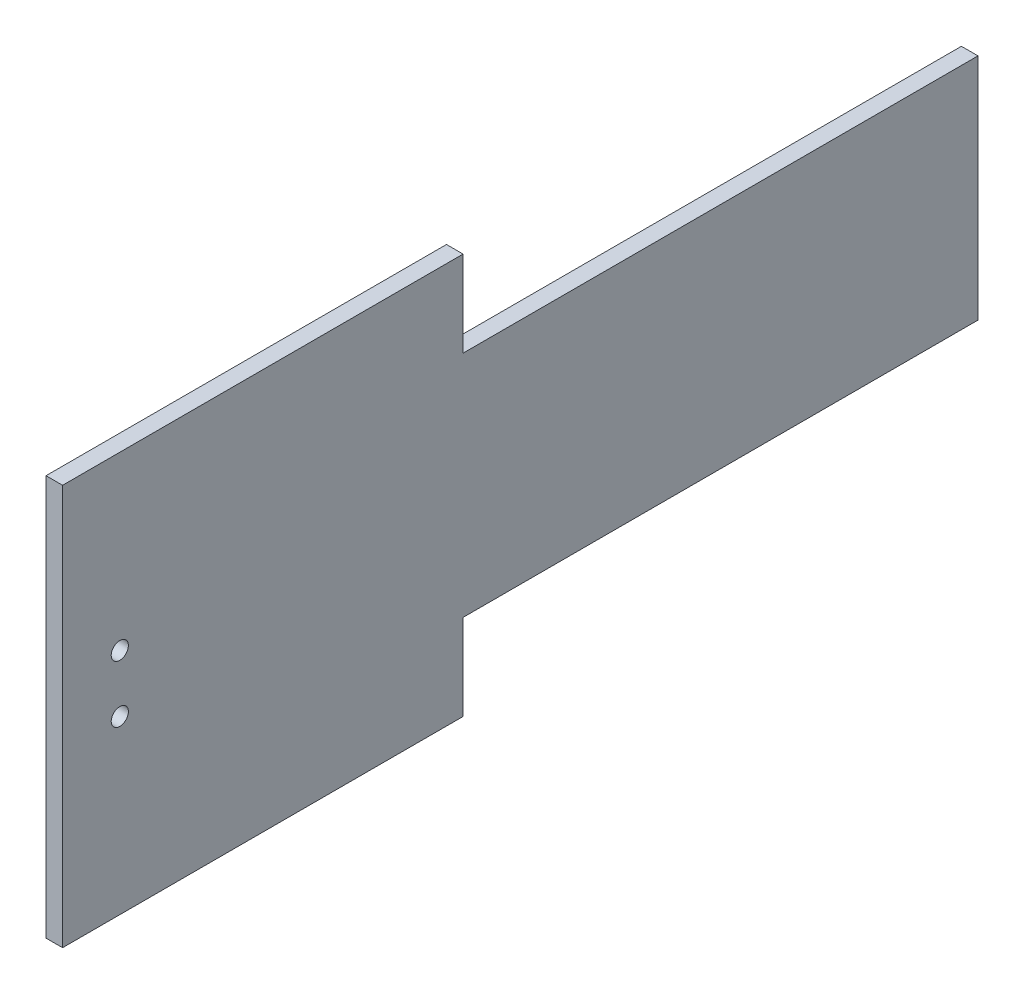
ISO-10303-21;
HEADER;
FILE_DESCRIPTION(('STEP AP214'),'2;1');
FILE_NAME('part.step','',(''),(''),'','','');
FILE_SCHEMA(('AUTOMOTIVE_DESIGN { 1 0 10303 214 1 1 1 1 }'));
ENDSEC;
DATA;
#1=APPLICATION_CONTEXT('core data for automotive mechanical design processes');
#2=APPLICATION_PROTOCOL_DEFINITION('international standard','automotive_design',2000,#1);
#3=PRODUCT_CONTEXT('',#1,'mechanical');
#4=PRODUCT('Part','Part','',(#3));
#5=PRODUCT_RELATED_PRODUCT_CATEGORY('part','',(#4));
#6=PRODUCT_DEFINITION_FORMATION('','',#4);
#7=PRODUCT_DEFINITION_CONTEXT('part definition',#1,'design');
#8=PRODUCT_DEFINITION('design','',#6,#7);
#9=PRODUCT_DEFINITION_SHAPE('','',#8);
#10=(LENGTH_UNIT() NAMED_UNIT(*) SI_UNIT(.MILLI.,.METRE.));
#11=(NAMED_UNIT(*) PLANE_ANGLE_UNIT() SI_UNIT($,.RADIAN.));
#12=(NAMED_UNIT(*) SI_UNIT($,.STERADIAN.) SOLID_ANGLE_UNIT());
#13=UNCERTAINTY_MEASURE_WITH_UNIT(LENGTH_MEASURE(1.E-05),#10,'distance_accuracy_value','');
#14=(GEOMETRIC_REPRESENTATION_CONTEXT(3) GLOBAL_UNCERTAINTY_ASSIGNED_CONTEXT((#13)) GLOBAL_UNIT_ASSIGNED_CONTEXT((#10,
#11,#12)) REPRESENTATION_CONTEXT('',''));
#15=CARTESIAN_POINT('',(0.,0.,0.));
#16=DIRECTION('',(0.,0.,1.));
#17=DIRECTION('',(1.,0.,0.));
#18=AXIS2_PLACEMENT_3D('',#15,#16,#17);
#19=CARTESIAN_POINT('',(2.9,0.,0.));
#20=DIRECTION('',(1.,0.,0.));
#21=DIRECTION('',(0.,0.,-1.));
#22=AXIS2_PLACEMENT_3D('',#19,#20,#21);
#23=PLANE('',#22);
#24=CARTESIAN_POINT('',(2.9,5.,25.));
#25=DIRECTION('',(1.,0.,0.));
#26=DIRECTION('',(0.,0.,-1.));
#27=AXIS2_PLACEMENT_3D('',#24,#25,#26);
#28=CIRCLE('',#27,1.5);
#29=CARTESIAN_POINT('',(2.9,5.,23.5));
#30=VERTEX_POINT('',#29);
#31=EDGE_CURVE('E134',#30,#30,#28,.T.);
#32=ORIENTED_EDGE('',*,*,#31,.F.);
#33=EDGE_LOOP('',(#32));
#34=FACE_BOUND('',#33,.T.);
#35=DIRECTION('',(0.,1.,0.));
#36=VECTOR('',#35,1.);
#37=CARTESIAN_POINT('',(2.9,-20.,-35.));
#38=LINE('',#37,#36);
#39=CARTESIAN_POINT('',(2.9,-35.,-35.));
#40=VERTEX_POINT('',#39);
#41=CARTESIAN_POINT('',(2.9,-20.,-35.));
#42=VERTEX_POINT('',#41);
#43=EDGE_CURVE('E145',#40,#42,#38,.T.);
#44=ORIENTED_EDGE('',*,*,#43,.T.);
#45=DIRECTION('',(0.,0.,-1.));
#46=VECTOR('',#45,1.);
#47=CARTESIAN_POINT('',(2.9,-20.,-125.));
#48=LINE('',#47,#46);
#49=CARTESIAN_POINT('',(2.9,-20.,-125.));
#50=VERTEX_POINT('',#49);
#51=EDGE_CURVE('E93',#42,#50,#48,.T.);
#52=ORIENTED_EDGE('',*,*,#51,.T.);
#53=DIRECTION('',(0.,1.,0.));
#54=VECTOR('',#53,1.);
#55=CARTESIAN_POINT('',(2.9,-20.,-125.));
#56=LINE('',#55,#54);
#57=CARTESIAN_POINT('',(2.9,20.,-125.));
#58=VERTEX_POINT('',#57);
#59=EDGE_CURVE('E160',#50,#58,#56,.T.);
#60=ORIENTED_EDGE('',*,*,#59,.T.);
#61=DIRECTION('',(0.,0.,1.));
#62=VECTOR('',#61,1.);
#63=CARTESIAN_POINT('',(2.9,20.,-125.));
#64=LINE('',#63,#62);
#65=CARTESIAN_POINT('',(2.9,20.,-35.));
#66=VERTEX_POINT('',#65);
#67=EDGE_CURVE('E173',#58,#66,#64,.T.);
#68=ORIENTED_EDGE('',*,*,#67,.T.);
#69=DIRECTION('',(0.,1.,0.));
#70=VECTOR('',#69,1.);
#71=CARTESIAN_POINT('',(2.9,35.,-35.));
#72=LINE('',#71,#70);
#73=CARTESIAN_POINT('',(2.9,35.,-35.));
#74=VERTEX_POINT('',#73);
#75=EDGE_CURVE('E112',#66,#74,#72,.T.);
#76=ORIENTED_EDGE('',*,*,#75,.T.);
#77=DIRECTION('',(0.,0.,1.));
#78=VECTOR('',#77,1.);
#79=CARTESIAN_POINT('',(2.9,35.,35.));
#80=LINE('',#79,#78);
#81=CARTESIAN_POINT('',(2.9,35.,35.));
#82=VERTEX_POINT('',#81);
#83=EDGE_CURVE('E106',#74,#82,#80,.T.);
#84=ORIENTED_EDGE('',*,*,#83,.T.);
#85=DIRECTION('',(0.,-1.,0.));
#86=VECTOR('',#85,1.);
#87=CARTESIAN_POINT('',(2.9,35.,35.));
#88=LINE('',#87,#86);
#89=CARTESIAN_POINT('',(2.9,-35.,35.));
#90=VERTEX_POINT('',#89);
#91=EDGE_CURVE('E110',#82,#90,#88,.T.);
#92=ORIENTED_EDGE('',*,*,#91,.T.);
#93=DIRECTION('',(0.,0.,-1.));
#94=VECTOR('',#93,1.);
#95=CARTESIAN_POINT('',(2.9,-35.,35.));
#96=LINE('',#95,#94);
#97=EDGE_CURVE('E50',#90,#40,#96,.T.);
#98=ORIENTED_EDGE('',*,*,#97,.T.);
#99=EDGE_LOOP('',(#44,#52,#60,#68,#76,#84,#92,#98));
#100=FACE_BOUND('',#99,.T.);
#101=CARTESIAN_POINT('',(2.9,-5.,25.));
#102=DIRECTION('',(1.,0.,0.));
#103=DIRECTION('',(0.,0.,-1.));
#104=AXIS2_PLACEMENT_3D('',#101,#102,#103);
#105=CIRCLE('',#104,1.5);
#106=CARTESIAN_POINT('',(2.9,-5.,23.5));
#107=VERTEX_POINT('',#106);
#108=EDGE_CURVE('E182',#107,#107,#105,.T.);
#109=ORIENTED_EDGE('',*,*,#108,.F.);
#110=EDGE_LOOP('',(#109));
#111=FACE_BOUND('',#110,.T.);
#112=ADVANCED_FACE('F33',(#34,#100,#111),#23,.T.);
#113=CARTESIAN_POINT('',(0.,0.,0.));
#114=DIRECTION('',(1.,0.,0.));
#115=DIRECTION('',(0.,0.,-1.));
#116=AXIS2_PLACEMENT_3D('',#113,#114,#115);
#117=PLANE('',#116);
#118=DIRECTION('',(0.,1.,0.));
#119=VECTOR('',#118,1.);
#120=CARTESIAN_POINT('',(0.,-20.,-35.));
#121=LINE('',#120,#119);
#122=CARTESIAN_POINT('',(0.,-35.,-35.));
#123=VERTEX_POINT('',#122);
#124=CARTESIAN_POINT('',(0.,-20.,-35.));
#125=VERTEX_POINT('',#124);
#126=EDGE_CURVE('E130',#123,#125,#121,.T.);
#127=ORIENTED_EDGE('',*,*,#126,.F.);
#128=DIRECTION('',(0.,0.,-1.));
#129=VECTOR('',#128,1.);
#130=CARTESIAN_POINT('',(0.,-35.,35.));
#131=LINE('',#130,#129);
#132=CARTESIAN_POINT('',(0.,-35.,35.));
#133=VERTEX_POINT('',#132);
#134=EDGE_CURVE('E85',#133,#123,#131,.T.);
#135=ORIENTED_EDGE('',*,*,#134,.F.);
#136=DIRECTION('',(0.,-1.,0.));
#137=VECTOR('',#136,1.);
#138=CARTESIAN_POINT('',(0.,35.,35.));
#139=LINE('',#138,#137);
#140=CARTESIAN_POINT('',(0.,35.,35.));
#141=VERTEX_POINT('',#140);
#142=EDGE_CURVE('E79',#141,#133,#139,.T.);
#143=ORIENTED_EDGE('',*,*,#142,.F.);
#144=DIRECTION('',(0.,0.,1.));
#145=VECTOR('',#144,1.);
#146=CARTESIAN_POINT('',(0.,35.,35.));
#147=LINE('',#146,#145);
#148=CARTESIAN_POINT('',(0.,35.,-35.));
#149=VERTEX_POINT('',#148);
#150=EDGE_CURVE('E120',#149,#141,#147,.T.);
#151=ORIENTED_EDGE('',*,*,#150,.F.);
#152=DIRECTION('',(0.,1.,0.));
#153=VECTOR('',#152,1.);
#154=CARTESIAN_POINT('',(0.,35.,-35.));
#155=LINE('',#154,#153);
#156=CARTESIAN_POINT('',(0.,20.,-35.));
#157=VERTEX_POINT('',#156);
#158=EDGE_CURVE('E140',#157,#149,#155,.T.);
#159=ORIENTED_EDGE('',*,*,#158,.F.);
#160=DIRECTION('',(0.,0.,1.));
#161=VECTOR('',#160,1.);
#162=CARTESIAN_POINT('',(0.,20.,-125.));
#163=LINE('',#162,#161);
#164=CARTESIAN_POINT('',(0.,20.,-125.));
#165=VERTEX_POINT('',#164);
#166=EDGE_CURVE('E138',#165,#157,#163,.T.);
#167=ORIENTED_EDGE('',*,*,#166,.F.);
#168=DIRECTION('',(0.,1.,0.));
#169=VECTOR('',#168,1.);
#170=CARTESIAN_POINT('',(0.,-20.,-125.));
#171=LINE('',#170,#169);
#172=CARTESIAN_POINT('',(0.,-20.,-125.));
#173=VERTEX_POINT('',#172);
#174=EDGE_CURVE('E136',#173,#165,#171,.T.);
#175=ORIENTED_EDGE('',*,*,#174,.F.);
#176=DIRECTION('',(0.,0.,-1.));
#177=VECTOR('',#176,1.);
#178=CARTESIAN_POINT('',(0.,-20.,-125.));
#179=LINE('',#178,#177);
#180=EDGE_CURVE('E133',#125,#173,#179,.T.);
#181=ORIENTED_EDGE('',*,*,#180,.F.);
#182=EDGE_LOOP('',(#127,#135,#143,#151,#159,#167,#175,#181));
#183=FACE_BOUND('',#182,.T.);
#184=CARTESIAN_POINT('',(0.,5.,25.));
#185=DIRECTION('',(1.,0.,0.));
#186=DIRECTION('',(0.,0.,-1.));
#187=AXIS2_PLACEMENT_3D('',#184,#185,#186);
#188=CIRCLE('',#187,1.5);
#189=CARTESIAN_POINT('',(0.,5.,23.5));
#190=VERTEX_POINT('',#189);
#191=EDGE_CURVE('E179',#190,#190,#188,.T.);
#192=ORIENTED_EDGE('',*,*,#191,.T.);
#193=EDGE_LOOP('',(#192));
#194=FACE_BOUND('',#193,.T.);
#195=CARTESIAN_POINT('',(0.,-5.,25.));
#196=DIRECTION('',(1.,0.,0.));
#197=DIRECTION('',(0.,0.,-1.));
#198=AXIS2_PLACEMENT_3D('',#195,#196,#197);
#199=CIRCLE('',#198,1.5);
#200=CARTESIAN_POINT('',(0.,-5.,23.5));
#201=VERTEX_POINT('',#200);
#202=EDGE_CURVE('E185',#201,#201,#199,.T.);
#203=ORIENTED_EDGE('',*,*,#202,.T.);
#204=EDGE_LOOP('',(#203));
#205=FACE_BOUND('',#204,.T.);
#206=ADVANCED_FACE('F164',(#183,#194,#205),#117,.F.);
#207=CARTESIAN_POINT('',(2.9,-20.,-35.));
#208=DIRECTION('',(0.,0.,1.));
#209=DIRECTION('',(0.,-1.,0.));
#210=AXIS2_PLACEMENT_3D('',#207,#208,#209);
#211=PLANE('',#210);
#212=ORIENTED_EDGE('',*,*,#126,.T.);
#213=DIRECTION('',(-1.,0.,0.));
#214=VECTOR('',#213,1.);
#215=CARTESIAN_POINT('',(2.9,-20.,-35.));
#216=LINE('',#215,#214);
#217=EDGE_CURVE('E11',#42,#125,#216,.T.);
#218=ORIENTED_EDGE('',*,*,#217,.F.);
#219=ORIENTED_EDGE('',*,*,#43,.F.);
#220=DIRECTION('',(-1.,0.,0.));
#221=VECTOR('',#220,1.);
#222=CARTESIAN_POINT('',(2.9,-35.,-35.));
#223=LINE('',#222,#221);
#224=EDGE_CURVE('E126',#40,#123,#223,.T.);
#225=ORIENTED_EDGE('',*,*,#224,.T.);
#226=EDGE_LOOP('',(#212,#218,#219,#225));
#227=FACE_BOUND('',#226,.T.);
#228=ADVANCED_FACE('F35',(#227),#211,.F.);
#229=CARTESIAN_POINT('',(2.9,-20.,-125.));
#230=DIRECTION('',(0.,1.,0.));
#231=DIRECTION('',(0.,0.,1.));
#232=AXIS2_PLACEMENT_3D('',#229,#230,#231);
#233=PLANE('',#232);
#234=ORIENTED_EDGE('',*,*,#180,.T.);
#235=DIRECTION('',(-1.,0.,0.));
#236=VECTOR('',#235,1.);
#237=CARTESIAN_POINT('',(2.9,-20.,-125.));
#238=LINE('',#237,#236);
#239=EDGE_CURVE('E42',#50,#173,#238,.T.);
#240=ORIENTED_EDGE('',*,*,#239,.F.);
#241=ORIENTED_EDGE('',*,*,#51,.F.);
#242=ORIENTED_EDGE('',*,*,#217,.T.);
#243=EDGE_LOOP('',(#234,#240,#241,#242));
#244=FACE_BOUND('',#243,.T.);
#245=ADVANCED_FACE('F217',(#244),#233,.F.);
#246=CARTESIAN_POINT('',(2.9,-20.,-125.));
#247=DIRECTION('',(0.,0.,1.));
#248=DIRECTION('',(1.,0.,0.));
#249=AXIS2_PLACEMENT_3D('',#246,#247,#248);
#250=PLANE('',#249);
#251=ORIENTED_EDGE('',*,*,#174,.T.);
#252=DIRECTION('',(-1.,0.,0.));
#253=VECTOR('',#252,1.);
#254=CARTESIAN_POINT('',(2.9,20.,-125.));
#255=LINE('',#254,#253);
#256=EDGE_CURVE('E152',#58,#165,#255,.T.);
#257=ORIENTED_EDGE('',*,*,#256,.F.);
#258=ORIENTED_EDGE('',*,*,#59,.F.);
#259=ORIENTED_EDGE('',*,*,#239,.T.);
#260=EDGE_LOOP('',(#251,#257,#258,#259));
#261=FACE_BOUND('',#260,.T.);
#262=ADVANCED_FACE('F158',(#261),#250,.F.);
#263=CARTESIAN_POINT('',(2.9,20.,-125.));
#264=DIRECTION('',(0.,-1.,0.));
#265=DIRECTION('',(0.,0.,-1.));
#266=AXIS2_PLACEMENT_3D('',#263,#264,#265);
#267=PLANE('',#266);
#268=ORIENTED_EDGE('',*,*,#166,.T.);
#269=DIRECTION('',(-1.,0.,0.));
#270=VECTOR('',#269,1.);
#271=CARTESIAN_POINT('',(2.9,20.,-35.));
#272=LINE('',#271,#270);
#273=EDGE_CURVE('E149',#66,#157,#272,.T.);
#274=ORIENTED_EDGE('',*,*,#273,.F.);
#275=ORIENTED_EDGE('',*,*,#67,.F.);
#276=ORIENTED_EDGE('',*,*,#256,.T.);
#277=EDGE_LOOP('',(#268,#274,#275,#276));
#278=FACE_BOUND('',#277,.T.);
#279=ADVANCED_FACE('F169',(#278),#267,.F.);
#280=CARTESIAN_POINT('',(2.9,35.,-35.));
#281=DIRECTION('',(0.,0.,1.));
#282=DIRECTION('',(0.,-1.,0.));
#283=AXIS2_PLACEMENT_3D('',#280,#281,#282);
#284=PLANE('',#283);
#285=ORIENTED_EDGE('',*,*,#158,.T.);
#286=DIRECTION('',(-1.,0.,0.));
#287=VECTOR('',#286,1.);
#288=CARTESIAN_POINT('',(2.9,35.,-35.));
#289=LINE('',#288,#287);
#290=EDGE_CURVE('E121',#74,#149,#289,.T.);
#291=ORIENTED_EDGE('',*,*,#290,.F.);
#292=ORIENTED_EDGE('',*,*,#75,.F.);
#293=ORIENTED_EDGE('',*,*,#273,.T.);
#294=EDGE_LOOP('',(#285,#291,#292,#293));
#295=FACE_BOUND('',#294,.T.);
#296=ADVANCED_FACE('F172',(#295),#284,.F.);
#297=CARTESIAN_POINT('',(2.9,35.,35.));
#298=DIRECTION('',(0.,-1.,0.));
#299=DIRECTION('',(0.,0.,-1.));
#300=AXIS2_PLACEMENT_3D('',#297,#298,#299);
#301=PLANE('',#300);
#302=ORIENTED_EDGE('',*,*,#150,.T.);
#303=DIRECTION('',(-1.,0.,0.));
#304=VECTOR('',#303,1.);
#305=CARTESIAN_POINT('',(2.9,35.,35.));
#306=LINE('',#305,#304);
#307=EDGE_CURVE('E117',#82,#141,#306,.T.);
#308=ORIENTED_EDGE('',*,*,#307,.F.);
#309=ORIENTED_EDGE('',*,*,#83,.F.);
#310=ORIENTED_EDGE('',*,*,#290,.T.);
#311=EDGE_LOOP('',(#302,#308,#309,#310));
#312=FACE_BOUND('',#311,.T.);
#313=ADVANCED_FACE('F118',(#312),#301,.F.);
#314=CARTESIAN_POINT('',(2.9,35.,35.));
#315=DIRECTION('',(0.,0.,-1.));
#316=DIRECTION('',(0.,1.,0.));
#317=AXIS2_PLACEMENT_3D('',#314,#315,#316);
#318=PLANE('',#317);
#319=ORIENTED_EDGE('',*,*,#142,.T.);
#320=DIRECTION('',(-1.,0.,0.));
#321=VECTOR('',#320,1.);
#322=CARTESIAN_POINT('',(2.9,-35.,35.));
#323=LINE('',#322,#321);
#324=EDGE_CURVE('E122',#90,#133,#323,.T.);
#325=ORIENTED_EDGE('',*,*,#324,.F.);
#326=ORIENTED_EDGE('',*,*,#91,.F.);
#327=ORIENTED_EDGE('',*,*,#307,.T.);
#328=EDGE_LOOP('',(#319,#325,#326,#327));
#329=FACE_BOUND('',#328,.T.);
#330=ADVANCED_FACE('F124',(#329),#318,.F.);
#331=CARTESIAN_POINT('',(2.9,-35.,35.));
#332=DIRECTION('',(0.,1.,0.));
#333=DIRECTION('',(0.,0.,1.));
#334=AXIS2_PLACEMENT_3D('',#331,#332,#333);
#335=PLANE('',#334);
#336=ORIENTED_EDGE('',*,*,#134,.T.);
#337=ORIENTED_EDGE('',*,*,#224,.F.);
#338=ORIENTED_EDGE('',*,*,#97,.F.);
#339=ORIENTED_EDGE('',*,*,#324,.T.);
#340=EDGE_LOOP('',(#336,#337,#338,#339));
#341=FACE_BOUND('',#340,.T.);
#342=ADVANCED_FACE('F205',(#341),#335,.F.);
#343=CARTESIAN_POINT('',(2.9,5.,25.));
#344=DIRECTION('',(-1.,0.,0.));
#345=DIRECTION('',(0.,0.,1.));
#346=AXIS2_PLACEMENT_3D('',#343,#344,#345);
#347=CYLINDRICAL_SURFACE('',#346,1.5);
#348=ORIENTED_EDGE('',*,*,#31,.T.);
#349=EDGE_LOOP('',(#348));
#350=FACE_BOUND('',#349,.T.);
#351=ORIENTED_EDGE('',*,*,#191,.F.);
#352=EDGE_LOOP('',(#351));
#353=FACE_BOUND('',#352,.T.);
#354=ADVANCED_FACE('F202',(#350,#353),#347,.F.);
#355=CARTESIAN_POINT('',(2.9,-5.,25.));
#356=DIRECTION('',(-1.,0.,0.));
#357=DIRECTION('',(0.,0.,1.));
#358=AXIS2_PLACEMENT_3D('',#355,#356,#357);
#359=CYLINDRICAL_SURFACE('',#358,1.5);
#360=ORIENTED_EDGE('',*,*,#108,.T.);
#361=EDGE_LOOP('',(#360));
#362=FACE_BOUND('',#361,.T.);
#363=ORIENTED_EDGE('',*,*,#202,.F.);
#364=EDGE_LOOP('',(#363));
#365=FACE_BOUND('',#364,.T.);
#366=ADVANCED_FACE('F191',(#362,#365),#359,.F.);
#367=CLOSED_SHELL('',(#112,#206,#228,#245,#262,#279,#296,#313,#330,#342,#354,#366));
#368=MANIFOLD_SOLID_BREP('B2',#367);
#369=ADVANCED_BREP_SHAPE_REPRESENTATION('',(#18,#368),#14);
#370=SHAPE_DEFINITION_REPRESENTATION(#9,#369);
ENDSEC;
END-ISO-10303-21;
